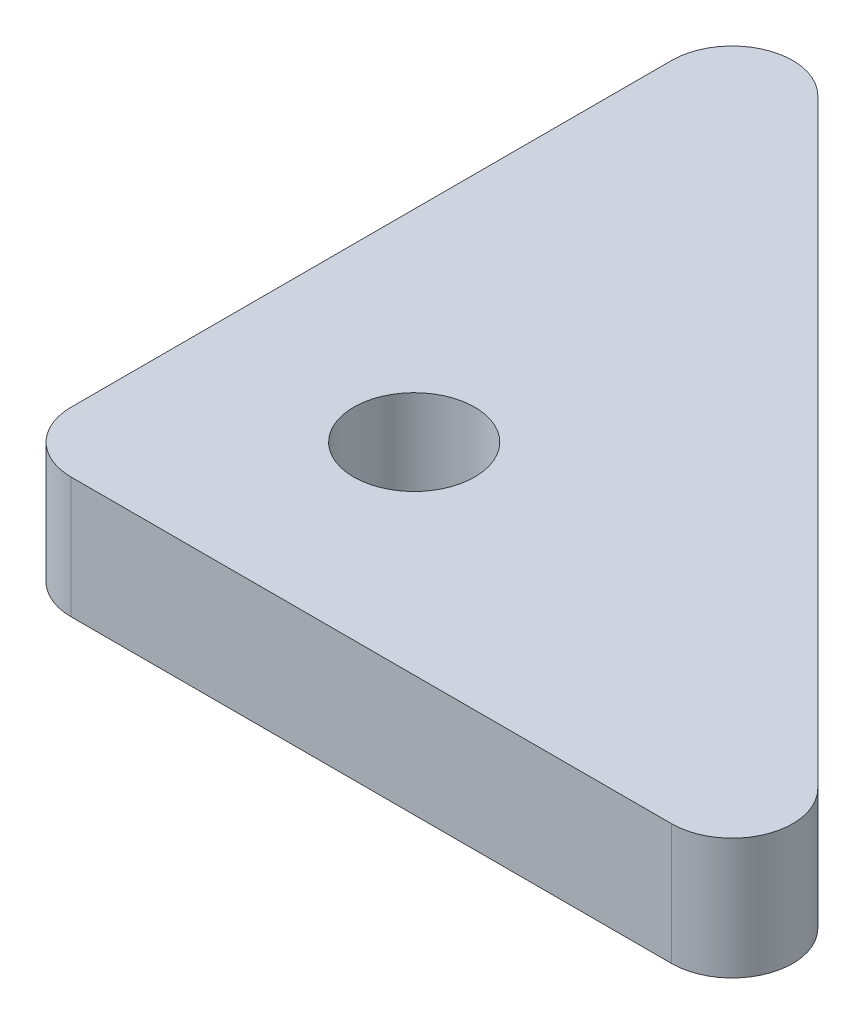
ISO-10303-21;
HEADER;
FILE_DESCRIPTION(('STEP AP214'),'2;1');
FILE_NAME('part.step','',(''),(''),'','','');
FILE_SCHEMA(('AUTOMOTIVE_DESIGN { 1 0 10303 214 1 1 1 1 }'));
ENDSEC;
DATA;
#1=APPLICATION_CONTEXT('core data for automotive mechanical design processes');
#2=APPLICATION_PROTOCOL_DEFINITION('international standard','automotive_design',2000,#1);
#3=PRODUCT_CONTEXT('',#1,'mechanical');
#4=PRODUCT('Part','Part','',(#3));
#5=PRODUCT_RELATED_PRODUCT_CATEGORY('part','',(#4));
#6=PRODUCT_DEFINITION_FORMATION('','',#4);
#7=PRODUCT_DEFINITION_CONTEXT('part definition',#1,'design');
#8=PRODUCT_DEFINITION('design','',#6,#7);
#9=PRODUCT_DEFINITION_SHAPE('','',#8);
#10=(LENGTH_UNIT() NAMED_UNIT(*) SI_UNIT(.MILLI.,.METRE.));
#11=(NAMED_UNIT(*) PLANE_ANGLE_UNIT() SI_UNIT($,.RADIAN.));
#12=(NAMED_UNIT(*) SI_UNIT($,.STERADIAN.) SOLID_ANGLE_UNIT());
#13=UNCERTAINTY_MEASURE_WITH_UNIT(LENGTH_MEASURE(1.E-05),#10,'distance_accuracy_value','');
#14=(GEOMETRIC_REPRESENTATION_CONTEXT(3) GLOBAL_UNCERTAINTY_ASSIGNED_CONTEXT((#13)) GLOBAL_UNIT_ASSIGNED_CONTEXT((#10,
#11,#12)) REPRESENTATION_CONTEXT('',''));
#15=CARTESIAN_POINT('',(0.,0.,0.));
#16=DIRECTION('',(0.,0.,1.));
#17=DIRECTION('',(1.,0.,0.));
#18=AXIS2_PLACEMENT_3D('',#15,#16,#17);
#19=CARTESIAN_POINT('',(2.99999999999984,6.00000000000001,-3.00000000000011));
#20=DIRECTION('',(0.,-1.,0.));
#21=DIRECTION('',(0.,0.,-1.00000000000002));
#22=AXIS2_PLACEMENT_3D('',#19,#20,#21);
#23=PLANE('',#22);
#24=CARTESIAN_POINT('',(2.99999999999984,6.00000000000001,-3.00000000000011));
#25=DIRECTION('',(0.,1.,0.));
#26=DIRECTION('',(0.,0.,-1.00000000000002));
#27=AXIS2_PLACEMENT_3D('',#24,#25,#26);
#28=CIRCLE('',#27,3.);
#29=CARTESIAN_POINT('',(-5.05151476204446E-12,6.00000000000001,-3.00000000000011));
#30=VERTEX_POINT('',#29);
#31=CARTESIAN_POINT('',(3.,6.00000000000001,0.));
#32=VERTEX_POINT('',#31);
#33=EDGE_CURVE('E130',#30,#32,#28,.T.);
#34=ORIENTED_EDGE('',*,*,#33,.T.);
#35=DIRECTION('',(1.00000000000007,0.,0.));
#36=VECTOR('',#35,1.);
#37=CARTESIAN_POINT('',(3.,6.00000000000001,0.));
#38=LINE('',#37,#36);
#39=CARTESIAN_POINT('',(32.7573593128806,6.00000000000001,0.));
#40=VERTEX_POINT('',#39);
#41=EDGE_CURVE('E88',#32,#40,#38,.T.);
#42=ORIENTED_EDGE('',*,*,#41,.T.);
#43=CARTESIAN_POINT('',(32.7573593128807,6.00000000000001,-3.00000000000011));
#44=DIRECTION('',(0.,1.,0.));
#45=DIRECTION('',(0.,0.,1.00000000000002));
#46=AXIS2_PLACEMENT_3D('',#43,#44,#45);
#47=CIRCLE('',#46,3.);
#48=CARTESIAN_POINT('',(34.8786796564401,6.00000000000001,-5.12132034355961));
#49=VERTEX_POINT('',#48);
#50=EDGE_CURVE('E101',#40,#49,#47,.T.);
#51=ORIENTED_EDGE('',*,*,#50,.T.);
#52=DIRECTION('',(-0.707106781186583,0.,-0.707106781186559));
#53=VECTOR('',#52,1.);
#54=CARTESIAN_POINT('',(5.12132034355811,6.00000000000001,-34.8786796564404));
#55=LINE('',#54,#53);
#56=CARTESIAN_POINT('',(5.12132034355811,6.00000000000001,-34.8786796564404));
#57=VERTEX_POINT('',#56);
#58=EDGE_CURVE('E95',#49,#57,#55,.T.);
#59=ORIENTED_EDGE('',*,*,#58,.T.);
#60=CARTESIAN_POINT('',(2.99999999999839,6.00000000000001,-32.7573593128807));
#61=DIRECTION('',(0.,1.,0.));
#62=DIRECTION('',(0.,0.,-1.00000000000002));
#63=AXIS2_PLACEMENT_3D('',#60,#61,#62);
#64=CIRCLE('',#63,3.);
#65=CARTESIAN_POINT('',(0.,6.00000000000001,-32.7573593128807));
#66=VERTEX_POINT('',#65);
#67=EDGE_CURVE('E99',#57,#66,#64,.T.);
#68=ORIENTED_EDGE('',*,*,#67,.T.);
#69=DIRECTION('',(0.,0.,1.00000000000002));
#70=VECTOR('',#69,1.);
#71=CARTESIAN_POINT('',(-5.05151476204446E-12,6.00000000000001,-3.00000000000011));
#72=LINE('',#71,#70);
#73=EDGE_CURVE('E51',#66,#30,#72,.T.);
#74=ORIENTED_EDGE('',*,*,#73,.T.);
#75=EDGE_LOOP('',(#34,#42,#51,#59,#68,#74));
#76=FACE_BOUND('',#75,.T.);
#77=CARTESIAN_POINT('',(9.9999999999984,6.00000000000001,-10.));
#78=DIRECTION('',(0.,1.,0.));
#79=DIRECTION('',(0.,0.,1.00000000000002));
#80=AXIS2_PLACEMENT_3D('',#77,#78,#79);
#81=CIRCLE('',#80,3.);
#82=CARTESIAN_POINT('',(9.9999999999984,6.00000000000001,-6.99999999999994));
#83=VERTEX_POINT('',#82);
#84=EDGE_CURVE('E123',#83,#83,#81,.T.);
#85=ORIENTED_EDGE('',*,*,#84,.F.);
#86=EDGE_LOOP('',(#85));
#87=FACE_BOUND('',#86,.T.);
#88=ADVANCED_FACE('F34',(#76,#87),#23,.F.);
#89=CARTESIAN_POINT('',(2.99999999999995,0.,-3.00000000000011));
#90=DIRECTION('',(0.,-1.,0.));
#91=DIRECTION('',(0.,0.,-1.00000000000002));
#92=AXIS2_PLACEMENT_3D('',#89,#90,#91);
#93=PLANE('',#92);
#94=CARTESIAN_POINT('',(2.99999999999995,0.,-3.00000000000011));
#95=DIRECTION('',(0.,1.,0.));
#96=DIRECTION('',(0.,0.,-1.00000000000002));
#97=AXIS2_PLACEMENT_3D('',#94,#95,#96);
#98=CIRCLE('',#97,3.);
#99=CARTESIAN_POINT('',(0.,0.,-3.00000000000011));
#100=VERTEX_POINT('',#99);
#101=CARTESIAN_POINT('',(3.,0.,0.));
#102=VERTEX_POINT('',#101);
#103=EDGE_CURVE('E119',#100,#102,#98,.T.);
#104=ORIENTED_EDGE('',*,*,#103,.F.);
#105=DIRECTION('',(0.,0.,1.00000000000002));
#106=VECTOR('',#105,1.);
#107=CARTESIAN_POINT('',(0.,0.,-3.00000000000011));
#108=LINE('',#107,#106);
#109=CARTESIAN_POINT('',(0.,0.,-32.7573593128807));
#110=VERTEX_POINT('',#109);
#111=EDGE_CURVE('E80',#110,#100,#108,.T.);
#112=ORIENTED_EDGE('',*,*,#111,.F.);
#113=CARTESIAN_POINT('',(2.99999999999839,0.,-32.7573593128807));
#114=DIRECTION('',(0.,1.,0.));
#115=DIRECTION('',(0.,0.,-1.00000000000002));
#116=AXIS2_PLACEMENT_3D('',#113,#114,#115);
#117=CIRCLE('',#116,3.);
#118=CARTESIAN_POINT('',(5.12132034355811,0.,-34.8786796564404));
#119=VERTEX_POINT('',#118);
#120=EDGE_CURVE('E74',#119,#110,#117,.T.);
#121=ORIENTED_EDGE('',*,*,#120,.F.);
#122=DIRECTION('',(-0.707106781186583,0.,-0.707106781186559));
#123=VECTOR('',#122,1.);
#124=CARTESIAN_POINT('',(5.12132034355811,0.,-34.8786796564404));
#125=LINE('',#124,#123);
#126=CARTESIAN_POINT('',(34.8786796564401,0.,-5.12132034355961));
#127=VERTEX_POINT('',#126);
#128=EDGE_CURVE('E109',#127,#119,#125,.T.);
#129=ORIENTED_EDGE('',*,*,#128,.F.);
#130=CARTESIAN_POINT('',(32.7573593128807,0.,-3.00000000000011));
#131=DIRECTION('',(0.,1.,0.));
#132=DIRECTION('',(0.,0.,1.00000000000002));
#133=AXIS2_PLACEMENT_3D('',#130,#131,#132);
#134=CIRCLE('',#133,3.);
#135=CARTESIAN_POINT('',(32.7573593128806,0.,0.));
#136=VERTEX_POINT('',#135);
#137=EDGE_CURVE('E125',#136,#127,#134,.T.);
#138=ORIENTED_EDGE('',*,*,#137,.F.);
#139=DIRECTION('',(1.00000000000007,0.,0.));
#140=VECTOR('',#139,1.);
#141=CARTESIAN_POINT('',(3.,0.,0.));
#142=LINE('',#141,#140);
#143=EDGE_CURVE('E122',#102,#136,#142,.T.);
#144=ORIENTED_EDGE('',*,*,#143,.F.);
#145=EDGE_LOOP('',(#104,#112,#121,#129,#138,#144));
#146=FACE_BOUND('',#145,.T.);
#147=CARTESIAN_POINT('',(9.9999999999984,0.,-10.));
#148=DIRECTION('',(0.,1.,0.));
#149=DIRECTION('',(0.,0.,1.00000000000002));
#150=AXIS2_PLACEMENT_3D('',#147,#148,#149);
#151=CIRCLE('',#150,3.);
#152=CARTESIAN_POINT('',(9.9999999999984,0.,-6.99999999999994));
#153=VERTEX_POINT('',#152);
#154=EDGE_CURVE('E223',#153,#153,#151,.T.);
#155=ORIENTED_EDGE('',*,*,#154,.T.);
#156=EDGE_LOOP('',(#155));
#157=FACE_BOUND('',#156,.T.);
#158=ADVANCED_FACE('F139',(#146,#157),#93,.T.);
#159=CARTESIAN_POINT('',(2.99999999999984,6.00000000000001,-3.00000000000011));
#160=DIRECTION('',(0.,-1.,0.));
#161=DIRECTION('',(0.,0.,-1.00000000000002));
#162=AXIS2_PLACEMENT_3D('',#159,#160,#161);
#163=CYLINDRICAL_SURFACE('',#162,3.);
#164=ORIENTED_EDGE('',*,*,#103,.T.);
#165=DIRECTION('',(0.,-1.,0.));
#166=VECTOR('',#165,1.);
#167=CARTESIAN_POINT('',(3.,6.00000000000001,0.));
#168=LINE('',#167,#166);
#169=EDGE_CURVE('E11',#32,#102,#168,.T.);
#170=ORIENTED_EDGE('',*,*,#169,.F.);
#171=ORIENTED_EDGE('',*,*,#33,.F.);
#172=DIRECTION('',(0.,-1.,0.));
#173=VECTOR('',#172,1.);
#174=CARTESIAN_POINT('',(-5.05151476204446E-12,6.00000000000001,-3.00000000000011));
#175=LINE('',#174,#173);
#176=EDGE_CURVE('E115',#30,#100,#175,.T.);
#177=ORIENTED_EDGE('',*,*,#176,.T.);
#178=EDGE_LOOP('',(#164,#170,#171,#177));
#179=FACE_BOUND('',#178,.T.);
#180=ADVANCED_FACE('F36',(#179),#163,.T.);
#181=CARTESIAN_POINT('',(3.,6.00000000000001,0.));
#182=DIRECTION('',(0.,0.,-1.00000000000002));
#183=DIRECTION('',(-1.00000000000007,0.,0.));
#184=AXIS2_PLACEMENT_3D('',#181,#182,#183);
#185=PLANE('',#184);
#186=ORIENTED_EDGE('',*,*,#143,.T.);
#187=DIRECTION('',(0.,-1.,0.));
#188=VECTOR('',#187,1.);
#189=CARTESIAN_POINT('',(32.7573593128806,6.00000000000001,0.));
#190=LINE('',#189,#188);
#191=EDGE_CURVE('E43',#40,#136,#190,.T.);
#192=ORIENTED_EDGE('',*,*,#191,.F.);
#193=ORIENTED_EDGE('',*,*,#41,.F.);
#194=ORIENTED_EDGE('',*,*,#169,.T.);
#195=EDGE_LOOP('',(#186,#192,#193,#194));
#196=FACE_BOUND('',#195,.T.);
#197=ADVANCED_FACE('F164',(#196),#185,.F.);
#198=CARTESIAN_POINT('',(32.7573593128807,6.00000000000001,-3.00000000000011));
#199=DIRECTION('',(0.,-1.,0.));
#200=DIRECTION('',(0.,0.,-1.00000000000002));
#201=AXIS2_PLACEMENT_3D('',#198,#199,#200);
#202=CYLINDRICAL_SURFACE('',#201,3.);
#203=ORIENTED_EDGE('',*,*,#137,.T.);
#204=DIRECTION('',(0.,-1.,0.));
#205=VECTOR('',#204,1.);
#206=CARTESIAN_POINT('',(34.8786796564401,6.00000000000001,-5.12132034355961));
#207=LINE('',#206,#205);
#208=EDGE_CURVE('E110',#49,#127,#207,.T.);
#209=ORIENTED_EDGE('',*,*,#208,.F.);
#210=ORIENTED_EDGE('',*,*,#50,.F.);
#211=ORIENTED_EDGE('',*,*,#191,.T.);
#212=EDGE_LOOP('',(#203,#209,#210,#211));
#213=FACE_BOUND('',#212,.T.);
#214=ADVANCED_FACE('F136',(#213),#202,.T.);
#215=CARTESIAN_POINT('',(5.12132034355811,6.00000000000001,-34.8786796564404));
#216=DIRECTION('',(-0.707106781186583,0.,0.707106781186559));
#217=DIRECTION('',(0.707106781186583,0.,0.707106781186559));
#218=AXIS2_PLACEMENT_3D('',#215,#216,#217);
#219=PLANE('',#218);
#220=ORIENTED_EDGE('',*,*,#128,.T.);
#221=DIRECTION('',(0.,-1.,0.));
#222=VECTOR('',#221,1.);
#223=CARTESIAN_POINT('',(5.12132034355811,6.00000000000001,-34.8786796564404));
#224=LINE('',#223,#222);
#225=EDGE_CURVE('E106',#57,#119,#224,.T.);
#226=ORIENTED_EDGE('',*,*,#225,.F.);
#227=ORIENTED_EDGE('',*,*,#58,.F.);
#228=ORIENTED_EDGE('',*,*,#208,.T.);
#229=EDGE_LOOP('',(#220,#226,#227,#228));
#230=FACE_BOUND('',#229,.T.);
#231=ADVANCED_FACE('F107',(#230),#219,.F.);
#232=CARTESIAN_POINT('',(2.99999999999839,6.00000000000001,-32.7573593128807));
#233=DIRECTION('',(0.,-1.,0.));
#234=DIRECTION('',(0.,0.,-1.00000000000002));
#235=AXIS2_PLACEMENT_3D('',#232,#233,#234);
#236=CYLINDRICAL_SURFACE('',#235,3.);
#237=ORIENTED_EDGE('',*,*,#120,.T.);
#238=DIRECTION('',(0.,-1.,0.));
#239=VECTOR('',#238,1.);
#240=CARTESIAN_POINT('',(0.,6.00000000000001,-32.7573593128807));
#241=LINE('',#240,#239);
#242=EDGE_CURVE('E111',#66,#110,#241,.T.);
#243=ORIENTED_EDGE('',*,*,#242,.F.);
#244=ORIENTED_EDGE('',*,*,#67,.F.);
#245=ORIENTED_EDGE('',*,*,#225,.T.);
#246=EDGE_LOOP('',(#237,#243,#244,#245));
#247=FACE_BOUND('',#246,.T.);
#248=ADVANCED_FACE('F113',(#247),#236,.T.);
#249=CARTESIAN_POINT('',(-5.05151476204446E-12,6.00000000000001,-3.00000000000011));
#250=DIRECTION('',(1.00000000000007,0.,0.));
#251=DIRECTION('',(0.,0.,-1.00000000000002));
#252=AXIS2_PLACEMENT_3D('',#249,#250,#251);
#253=PLANE('',#252);
#254=ORIENTED_EDGE('',*,*,#111,.T.);
#255=ORIENTED_EDGE('',*,*,#176,.F.);
#256=ORIENTED_EDGE('',*,*,#73,.F.);
#257=ORIENTED_EDGE('',*,*,#242,.T.);
#258=EDGE_LOOP('',(#254,#255,#256,#257));
#259=FACE_BOUND('',#258,.T.);
#260=ADVANCED_FACE('F144',(#259),#253,.F.);
#261=CARTESIAN_POINT('',(9.9999999999984,6.00000000000001,-10.));
#262=DIRECTION('',(0.,-1.,0.));
#263=DIRECTION('',(0.,0.,-1.00000000000002));
#264=AXIS2_PLACEMENT_3D('',#261,#262,#263);
#265=CYLINDRICAL_SURFACE('',#264,3.);
#266=ORIENTED_EDGE('',*,*,#84,.T.);
#267=EDGE_LOOP('',(#266));
#268=FACE_BOUND('',#267,.T.);
#269=ORIENTED_EDGE('',*,*,#154,.F.);
#270=EDGE_LOOP('',(#269));
#271=FACE_BOUND('',#270,.T.);
#272=ADVANCED_FACE('F146',(#268,#271),#265,.F.);
#273=CLOSED_SHELL('',(#88,#158,#180,#197,#214,#231,#248,#260,#272));
#274=MANIFOLD_SOLID_BREP('B2',#273);
#275=ADVANCED_BREP_SHAPE_REPRESENTATION('',(#18,#274),#14);
#276=SHAPE_DEFINITION_REPRESENTATION(#9,#275);
ENDSEC;
END-ISO-10303-21;
